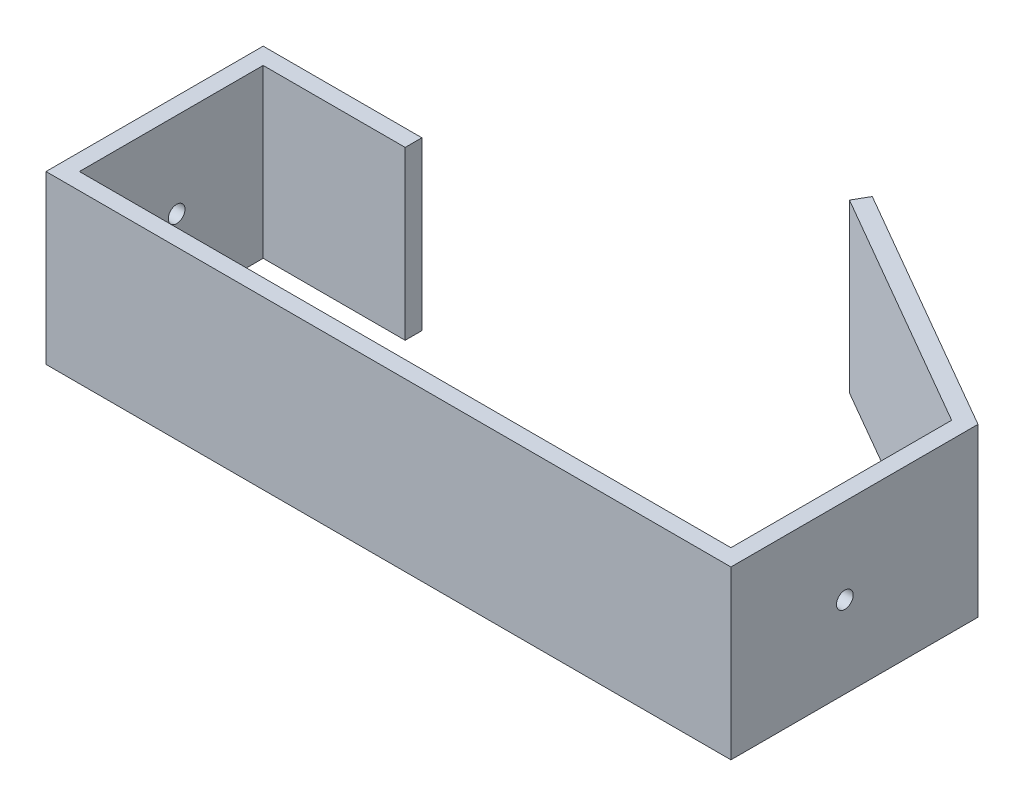
ISO-10303-21;
HEADER;
FILE_DESCRIPTION(('STEP AP214'),'2;1');
FILE_NAME('part.step','',(''),(''),'','','');
FILE_SCHEMA(('AUTOMOTIVE_DESIGN { 1 0 10303 214 1 1 1 1 }'));
ENDSEC;
DATA;
#1=APPLICATION_CONTEXT('core data for automotive mechanical design processes');
#2=APPLICATION_PROTOCOL_DEFINITION('international standard','automotive_design',2000,#1);
#3=PRODUCT_CONTEXT('',#1,'mechanical');
#4=PRODUCT('Part','Part','',(#3));
#5=PRODUCT_RELATED_PRODUCT_CATEGORY('part','',(#4));
#6=PRODUCT_DEFINITION_FORMATION('','',#4);
#7=PRODUCT_DEFINITION_CONTEXT('part definition',#1,'design');
#8=PRODUCT_DEFINITION('design','',#6,#7);
#9=PRODUCT_DEFINITION_SHAPE('','',#8);
#10=(LENGTH_UNIT() NAMED_UNIT(*) SI_UNIT(.MILLI.,.METRE.));
#11=(NAMED_UNIT(*) PLANE_ANGLE_UNIT() SI_UNIT($,.RADIAN.));
#12=(NAMED_UNIT(*) SI_UNIT($,.STERADIAN.) SOLID_ANGLE_UNIT());
#13=UNCERTAINTY_MEASURE_WITH_UNIT(LENGTH_MEASURE(1.E-05),#10,'distance_accuracy_value','');
#14=(GEOMETRIC_REPRESENTATION_CONTEXT(3) GLOBAL_UNCERTAINTY_ASSIGNED_CONTEXT((#13)) GLOBAL_UNIT_ASSIGNED_CONTEXT((#10,
#11,#12)) REPRESENTATION_CONTEXT('',''));
#15=CARTESIAN_POINT('',(0.,0.,0.));
#16=DIRECTION('',(0.,0.,1.));
#17=DIRECTION('',(1.,0.,0.));
#18=AXIS2_PLACEMENT_3D('',#15,#16,#17);
#19=CARTESIAN_POINT('',(-126.387840678323,50.,54.9999999999998));
#20=DIRECTION('',(0.,0.,-1.));
#21=DIRECTION('',(-1.,0.,0.));
#22=AXIS2_PLACEMENT_3D('',#19,#20,#21);
#23=PLANE('',#22);
#24=DIRECTION('',(1.,0.,0.));
#25=VECTOR('',#24,1.);
#26=CARTESIAN_POINT('',(-126.387840678323,0.,54.9999999999998));
#27=LINE('',#26,#25);
#28=CARTESIAN_POINT('',(-123.887840678323,0.,54.9999999999998));
#29=VERTEX_POINT('',#28);
#30=CARTESIAN_POINT('',(-81.3878406783226,0.,54.9999999999998));
#31=VERTEX_POINT('',#30);
#32=EDGE_CURVE('E165',#29,#31,#27,.T.);
#33=ORIENTED_EDGE('',*,*,#32,.T.);
#34=DIRECTION('',(0.,-1.,0.));
#35=VECTOR('',#34,1.);
#36=CARTESIAN_POINT('',(-81.3878406783226,50.,54.9999999999998));
#37=LINE('',#36,#35);
#38=CARTESIAN_POINT('',(-81.3878406783226,50.,54.9999999999998));
#39=VERTEX_POINT('',#38);
#40=EDGE_CURVE('E11',#39,#31,#37,.T.);
#41=ORIENTED_EDGE('',*,*,#40,.F.);
#42=DIRECTION('',(1.,0.,0.));
#43=VECTOR('',#42,1.);
#44=CARTESIAN_POINT('',(-126.387840678323,50.,54.9999999999998));
#45=LINE('',#44,#43);
#46=CARTESIAN_POINT('',(-123.887840678323,50.,54.9999999999998));
#47=VERTEX_POINT('',#46);
#48=EDGE_CURVE('E109',#47,#39,#45,.T.);
#49=ORIENTED_EDGE('',*,*,#48,.F.);
#50=DIRECTION('',(0.,-1.,0.));
#51=VECTOR('',#50,1.);
#52=CARTESIAN_POINT('',(-123.887840678323,50.,54.9999999999998));
#53=LINE('',#52,#51);
#54=EDGE_CURVE('E161',#47,#29,#53,.T.);
#55=ORIENTED_EDGE('',*,*,#54,.T.);
#56=EDGE_LOOP('',(#33,#41,#49,#55));
#57=FACE_BOUND('',#56,.T.);
#58=ADVANCED_FACE('F39',(#57),#23,.F.);
#59=CARTESIAN_POINT('',(-81.3878406783226,50.,49.9999999999998));
#60=DIRECTION('',(1.,0.,0.));
#61=DIRECTION('',(0.,0.,-1.));
#62=AXIS2_PLACEMENT_3D('',#59,#60,#61);
#63=PLANE('',#62);
#64=DIRECTION('',(0.,0.,1.));
#65=VECTOR('',#64,1.);
#66=CARTESIAN_POINT('',(-81.3878406783226,0.,49.9999999999998));
#67=LINE('',#66,#65);
#68=CARTESIAN_POINT('',(-81.3878406783226,0.,49.9999999999998));
#69=VERTEX_POINT('',#68);
#70=EDGE_CURVE('E169',#69,#31,#67,.T.);
#71=ORIENTED_EDGE('',*,*,#70,.F.);
#72=DIRECTION('',(0.,-1.,0.));
#73=VECTOR('',#72,1.);
#74=CARTESIAN_POINT('',(-81.3878406783226,50.,49.9999999999998));
#75=LINE('',#74,#73);
#76=CARTESIAN_POINT('',(-81.3878406783226,50.,49.9999999999998));
#77=VERTEX_POINT('',#76);
#78=EDGE_CURVE('E49',#77,#69,#75,.T.);
#79=ORIENTED_EDGE('',*,*,#78,.F.);
#80=DIRECTION('',(0.,0.,1.));
#81=VECTOR('',#80,1.);
#82=CARTESIAN_POINT('',(-81.3878406783226,50.,49.9999999999998));
#83=LINE('',#82,#81);
#84=EDGE_CURVE('E254',#77,#39,#83,.T.);
#85=ORIENTED_EDGE('',*,*,#84,.T.);
#86=ORIENTED_EDGE('',*,*,#40,.T.);
#87=EDGE_LOOP('',(#71,#79,#85,#86));
#88=FACE_BOUND('',#87,.T.);
#89=ADVANCED_FACE('F241',(#88),#63,.T.);
#90=CARTESIAN_POINT('',(-126.387840678323,50.,49.9999999999998));
#91=DIRECTION('',(0.,0.,-1.));
#92=DIRECTION('',(-1.,0.,0.));
#93=AXIS2_PLACEMENT_3D('',#90,#91,#92);
#94=PLANE('',#93);
#95=DIRECTION('',(1.,0.,0.));
#96=VECTOR('',#95,1.);
#97=CARTESIAN_POINT('',(-126.387840678323,0.,49.9999999999998));
#98=LINE('',#97,#96);
#99=CARTESIAN_POINT('',(-128.887840678323,0.,49.9999999999998));
#100=VERTEX_POINT('',#99);
#101=EDGE_CURVE('E174',#100,#69,#98,.T.);
#102=ORIENTED_EDGE('',*,*,#101,.F.);
#103=DIRECTION('',(0.,-1.,0.));
#104=VECTOR('',#103,1.);
#105=CARTESIAN_POINT('',(-128.887840678323,50.,49.9999999999998));
#106=LINE('',#105,#104);
#107=CARTESIAN_POINT('',(-128.887840678323,50.,49.9999999999998));
#108=VERTEX_POINT('',#107);
#109=EDGE_CURVE('E228',#108,#100,#106,.T.);
#110=ORIENTED_EDGE('',*,*,#109,.F.);
#111=DIRECTION('',(1.,0.,0.));
#112=VECTOR('',#111,1.);
#113=CARTESIAN_POINT('',(-126.387840678323,50.,49.9999999999998));
#114=LINE('',#113,#112);
#115=EDGE_CURVE('E238',#108,#77,#114,.T.);
#116=ORIENTED_EDGE('',*,*,#115,.T.);
#117=ORIENTED_EDGE('',*,*,#78,.T.);
#118=EDGE_LOOP('',(#102,#110,#116,#117));
#119=FACE_BOUND('',#118,.T.);
#120=ADVANCED_FACE('F236',(#119),#94,.T.);
#121=CARTESIAN_POINT('',(-128.887840678323,50.,112.5));
#122=DIRECTION('',(-1.,0.,0.));
#123=DIRECTION('',(0.,0.,1.));
#124=AXIS2_PLACEMENT_3D('',#121,#122,#123);
#125=PLANE('',#124);
#126=CARTESIAN_POINT('',(-128.887840678323,24.4516669544434,80.9096776134965));
#127=DIRECTION('',(1.,0.,0.));
#128=DIRECTION('',(0.,0.,-1.));
#129=AXIS2_PLACEMENT_3D('',#126,#127,#128);
#130=CIRCLE('',#129,2.5);
#131=CARTESIAN_POINT('',(-128.887840678323,24.4516669544434,78.4096776134965));
#132=VERTEX_POINT('',#131);
#133=EDGE_CURVE('E335',#132,#132,#130,.T.);
#134=ORIENTED_EDGE('',*,*,#133,.T.);
#135=EDGE_LOOP('',(#134));
#136=FACE_BOUND('',#135,.T.);
#137=DIRECTION('',(0.,0.,-1.));
#138=VECTOR('',#137,1.);
#139=CARTESIAN_POINT('',(-128.887840678323,0.,112.5));
#140=LINE('',#139,#138);
#141=CARTESIAN_POINT('',(-128.887840678323,0.,115.));
#142=VERTEX_POINT('',#141);
#143=EDGE_CURVE('E178',#142,#100,#140,.T.);
#144=ORIENTED_EDGE('',*,*,#143,.F.);
#145=DIRECTION('',(0.,-1.,0.));
#146=VECTOR('',#145,1.);
#147=CARTESIAN_POINT('',(-128.887840678323,50.,115.));
#148=LINE('',#147,#146);
#149=CARTESIAN_POINT('',(-128.887840678323,50.,115.));
#150=VERTEX_POINT('',#149);
#151=EDGE_CURVE('E225',#150,#142,#148,.T.);
#152=ORIENTED_EDGE('',*,*,#151,.F.);
#153=DIRECTION('',(0.,0.,-1.));
#154=VECTOR('',#153,1.);
#155=CARTESIAN_POINT('',(-128.887840678323,50.,112.5));
#156=LINE('',#155,#154);
#157=EDGE_CURVE('E251',#150,#108,#156,.T.);
#158=ORIENTED_EDGE('',*,*,#157,.T.);
#159=ORIENTED_EDGE('',*,*,#109,.T.);
#160=EDGE_LOOP('',(#144,#152,#158,#159));
#161=FACE_BOUND('',#160,.T.);
#162=ADVANCED_FACE('F248',(#136,#161),#125,.T.);
#163=CARTESIAN_POINT('',(73.6121593216774,50.,115.));
#164=DIRECTION('',(0.,0.,1.));
#165=DIRECTION('',(1.,0.,0.));
#166=AXIS2_PLACEMENT_3D('',#163,#164,#165);
#167=PLANE('',#166);
#168=DIRECTION('',(1.,0.,0.));
#169=VECTOR('',#168,1.);
#170=CARTESIAN_POINT('',(73.6121593216774,0.,115.));
#171=LINE('',#170,#169);
#172=CARTESIAN_POINT('',(76.1121593216774,0.,115.));
#173=VERTEX_POINT('',#172);
#174=EDGE_CURVE('E182',#173,#142,#171,.F.);
#175=ORIENTED_EDGE('',*,*,#174,.F.);
#176=DIRECTION('',(0.,-1.,0.));
#177=VECTOR('',#176,1.);
#178=CARTESIAN_POINT('',(76.1121593216774,50.,115.));
#179=LINE('',#178,#177);
#180=CARTESIAN_POINT('',(76.1121593216774,50.,115.));
#181=VERTEX_POINT('',#180);
#182=EDGE_CURVE('E222',#181,#173,#179,.T.);
#183=ORIENTED_EDGE('',*,*,#182,.F.);
#184=DIRECTION('',(1.,0.,0.));
#185=VECTOR('',#184,1.);
#186=CARTESIAN_POINT('',(73.6121593216774,50.,115.));
#187=LINE('',#186,#185);
#188=EDGE_CURVE('E259',#181,#150,#187,.F.);
#189=ORIENTED_EDGE('',*,*,#188,.T.);
#190=ORIENTED_EDGE('',*,*,#151,.T.);
#191=EDGE_LOOP('',(#175,#183,#189,#190));
#192=FACE_BOUND('',#191,.T.);
#193=ADVANCED_FACE('F347',(#192),#167,.T.);
#194=CARTESIAN_POINT('',(76.1121593216774,50.,42.4999999999998));
#195=DIRECTION('',(1.,0.,0.));
#196=DIRECTION('',(0.,0.,-1.));
#197=AXIS2_PLACEMENT_3D('',#194,#195,#196);
#198=PLANE('',#197);
#199=CARTESIAN_POINT('',(76.1121593216774,24.4516669544434,80.9096776134965));
#200=DIRECTION('',(1.,0.,0.));
#201=DIRECTION('',(0.,0.,-1.));
#202=AXIS2_PLACEMENT_3D('',#199,#200,#201);
#203=CIRCLE('',#202,2.5);
#204=CARTESIAN_POINT('',(76.1121593216774,24.4516669544434,78.4096776134965));
#205=VERTEX_POINT('',#204);
#206=EDGE_CURVE('E329',#205,#205,#203,.T.);
#207=ORIENTED_EDGE('',*,*,#206,.F.);
#208=EDGE_LOOP('',(#207));
#209=FACE_BOUND('',#208,.T.);
#210=DIRECTION('',(0.,0.,-1.));
#211=VECTOR('',#210,1.);
#212=CARTESIAN_POINT('',(76.1121593216774,0.,42.4999999999998));
#213=LINE('',#212,#211);
#214=CARTESIAN_POINT('',(76.1121593216774,0.,41.0566243270257));
#215=VERTEX_POINT('',#214);
#216=EDGE_CURVE('E186',#215,#173,#213,.F.);
#217=ORIENTED_EDGE('',*,*,#216,.F.);
#218=DIRECTION('',(0.,-1.,0.));
#219=VECTOR('',#218,1.);
#220=CARTESIAN_POINT('',(76.1121593216774,50.,41.0566243270257));
#221=LINE('',#220,#219);
#222=CARTESIAN_POINT('',(76.1121593216774,50.,41.0566243270257));
#223=VERTEX_POINT('',#222);
#224=EDGE_CURVE('E219',#223,#215,#221,.T.);
#225=ORIENTED_EDGE('',*,*,#224,.F.);
#226=DIRECTION('',(0.,0.,-1.));
#227=VECTOR('',#226,1.);
#228=CARTESIAN_POINT('',(76.1121593216774,50.,42.4999999999998));
#229=LINE('',#228,#227);
#230=EDGE_CURVE('E266',#223,#181,#229,.F.);
#231=ORIENTED_EDGE('',*,*,#230,.T.);
#232=ORIENTED_EDGE('',*,*,#182,.T.);
#233=EDGE_LOOP('',(#217,#225,#231,#232));
#234=FACE_BOUND('',#233,.T.);
#235=ADVANCED_FACE('F353',(#209,#234),#198,.T.);
#236=CARTESIAN_POINT('',(1.24999999999999,50.,-2.1650635094611));
#237=DIRECTION('',(0.499999999999998,0.,-0.86602540378444));
#238=DIRECTION('',(-0.86602540378444,0.,-0.499999999999998));
#239=AXIS2_PLACEMENT_3D('',#236,#237,#238);
#240=PLANE('',#239);
#241=DIRECTION('',(0.86602540378444,0.,0.499999999999998));
#242=VECTOR('',#241,1.);
#243=CARTESIAN_POINT('',(1.24999999999999,0.,-2.1650635094611));
#244=LINE('',#243,#242);
#245=CARTESIAN_POINT('',(1.24999999999999,0.,-2.1650635094611));
#246=VERTEX_POINT('',#245);
#247=EDGE_CURVE('E190',#246,#215,#244,.T.);
#248=ORIENTED_EDGE('',*,*,#247,.F.);
#249=DIRECTION('',(0.,-1.,0.));
#250=VECTOR('',#249,1.);
#251=CARTESIAN_POINT('',(1.24999999999999,50.,-2.1650635094611));
#252=LINE('',#251,#250);
#253=CARTESIAN_POINT('',(1.24999999999999,50.,-2.1650635094611));
#254=VERTEX_POINT('',#253);
#255=EDGE_CURVE('E216',#254,#246,#252,.T.);
#256=ORIENTED_EDGE('',*,*,#255,.F.);
#257=DIRECTION('',(0.86602540378444,0.,0.499999999999998));
#258=VECTOR('',#257,1.);
#259=CARTESIAN_POINT('',(1.24999999999999,50.,-2.1650635094611));
#260=LINE('',#259,#258);
#261=EDGE_CURVE('E270',#254,#223,#260,.T.);
#262=ORIENTED_EDGE('',*,*,#261,.T.);
#263=ORIENTED_EDGE('',*,*,#224,.T.);
#264=EDGE_LOOP('',(#248,#256,#262,#263));
#265=FACE_BOUND('',#264,.T.);
#266=ADVANCED_FACE('F285',(#265),#240,.T.);
#267=CARTESIAN_POINT('',(-1.24999999999999,50.,2.1650635094611));
#268=DIRECTION('',(-0.86602540378444,0.,-0.499999999999998));
#269=DIRECTION('',(-0.499999999999998,0.,0.86602540378444));
#270=AXIS2_PLACEMENT_3D('',#267,#268,#269);
#271=PLANE('',#270);
#272=DIRECTION('',(0.499999999999998,0.,-0.86602540378444));
#273=VECTOR('',#272,1.);
#274=CARTESIAN_POINT('',(-1.24999999999999,0.,2.1650635094611));
#275=LINE('',#274,#273);
#276=CARTESIAN_POINT('',(-1.24999999999999,0.,2.1650635094611));
#277=VERTEX_POINT('',#276);
#278=EDGE_CURVE('E194',#277,#246,#275,.T.);
#279=ORIENTED_EDGE('',*,*,#278,.F.);
#280=DIRECTION('',(0.,-1.,0.));
#281=VECTOR('',#280,1.);
#282=CARTESIAN_POINT('',(-1.24999999999999,50.,2.1650635094611));
#283=LINE('',#282,#281);
#284=CARTESIAN_POINT('',(-1.24999999999999,50.,2.1650635094611));
#285=VERTEX_POINT('',#284);
#286=EDGE_CURVE('E213',#285,#277,#283,.T.);
#287=ORIENTED_EDGE('',*,*,#286,.F.);
#288=DIRECTION('',(0.499999999999998,0.,-0.86602540378444));
#289=VECTOR('',#288,1.);
#290=CARTESIAN_POINT('',(-1.24999999999999,50.,2.1650635094611));
#291=LINE('',#290,#289);
#292=EDGE_CURVE('E274',#285,#254,#291,.T.);
#293=ORIENTED_EDGE('',*,*,#292,.T.);
#294=ORIENTED_EDGE('',*,*,#255,.T.);
#295=EDGE_LOOP('',(#279,#287,#293,#294));
#296=FACE_BOUND('',#295,.T.);
#297=ADVANCED_FACE('F280',(#296),#271,.T.);
#298=CARTESIAN_POINT('',(-1.24999999999999,50.,2.1650635094611));
#299=DIRECTION('',(0.499999999999998,0.,-0.86602540378444));
#300=DIRECTION('',(-0.86602540378444,0.,-0.499999999999998));
#301=AXIS2_PLACEMENT_3D('',#298,#299,#300);
#302=PLANE('',#301);
#303=DIRECTION('',(0.86602540378444,0.,0.499999999999998));
#304=VECTOR('',#303,1.);
#305=CARTESIAN_POINT('',(-1.24999999999999,0.,2.1650635094611));
#306=LINE('',#305,#304);
#307=CARTESIAN_POINT('',(71.1121593216774,0.,43.9433756729739));
#308=VERTEX_POINT('',#307);
#309=EDGE_CURVE('E198',#277,#308,#306,.T.);
#310=ORIENTED_EDGE('',*,*,#309,.T.);
#311=DIRECTION('',(0.,-1.,0.));
#312=VECTOR('',#311,1.);
#313=CARTESIAN_POINT('',(71.1121593216774,50.,43.9433756729739));
#314=LINE('',#313,#312);
#315=CARTESIAN_POINT('',(71.1121593216774,50.,43.9433756729739));
#316=VERTEX_POINT('',#315);
#317=EDGE_CURVE('E154',#316,#308,#314,.T.);
#318=ORIENTED_EDGE('',*,*,#317,.F.);
#319=DIRECTION('',(0.86602540378444,0.,0.499999999999998));
#320=VECTOR('',#319,1.);
#321=CARTESIAN_POINT('',(-1.24999999999999,50.,2.1650635094611));
#322=LINE('',#321,#320);
#323=EDGE_CURVE('E143',#285,#316,#322,.T.);
#324=ORIENTED_EDGE('',*,*,#323,.F.);
#325=ORIENTED_EDGE('',*,*,#286,.T.);
#326=EDGE_LOOP('',(#310,#318,#324,#325));
#327=FACE_BOUND('',#326,.T.);
#328=ADVANCED_FACE('F289',(#327),#302,.F.);
#329=CARTESIAN_POINT('',(71.1121593216774,50.,42.4999999999998));
#330=DIRECTION('',(1.,0.,0.));
#331=DIRECTION('',(0.,0.,-1.));
#332=AXIS2_PLACEMENT_3D('',#329,#330,#331);
#333=PLANE('',#332);
#334=CARTESIAN_POINT('',(71.1121593216774,24.4516669544434,80.9096776134965));
#335=DIRECTION('',(1.,0.,0.));
#336=DIRECTION('',(0.,0.,-1.));
#337=AXIS2_PLACEMENT_3D('',#334,#335,#336);
#338=CIRCLE('',#337,2.5);
#339=CARTESIAN_POINT('',(71.1121593216774,24.4516669544434,78.4096776134965));
#340=VERTEX_POINT('',#339);
#341=EDGE_CURVE('E170',#340,#340,#338,.T.);
#342=ORIENTED_EDGE('',*,*,#341,.T.);
#343=EDGE_LOOP('',(#342));
#344=FACE_BOUND('',#343,.T.);
#345=DIRECTION('',(0.,0.,-1.));
#346=VECTOR('',#345,1.);
#347=CARTESIAN_POINT('',(71.1121593216774,0.,42.4999999999998));
#348=LINE('',#347,#346);
#349=CARTESIAN_POINT('',(71.1121593216774,0.,110.));
#350=VERTEX_POINT('',#349);
#351=EDGE_CURVE('E152',#308,#350,#348,.F.);
#352=ORIENTED_EDGE('',*,*,#351,.T.);
#353=DIRECTION('',(0.,-1.,0.));
#354=VECTOR('',#353,1.);
#355=CARTESIAN_POINT('',(71.1121593216774,50.,110.));
#356=LINE('',#355,#354);
#357=CARTESIAN_POINT('',(71.1121593216774,50.,110.));
#358=VERTEX_POINT('',#357);
#359=EDGE_CURVE('E149',#358,#350,#356,.T.);
#360=ORIENTED_EDGE('',*,*,#359,.F.);
#361=DIRECTION('',(0.,0.,-1.));
#362=VECTOR('',#361,1.);
#363=CARTESIAN_POINT('',(71.1121593216774,50.,42.4999999999998));
#364=LINE('',#363,#362);
#365=EDGE_CURVE('E136',#316,#358,#364,.F.);
#366=ORIENTED_EDGE('',*,*,#365,.F.);
#367=ORIENTED_EDGE('',*,*,#317,.T.);
#368=EDGE_LOOP('',(#352,#360,#366,#367));
#369=FACE_BOUND('',#368,.T.);
#370=ADVANCED_FACE('F150',(#344,#369),#333,.F.);
#371=CARTESIAN_POINT('',(73.6121593216774,50.,110.));
#372=DIRECTION('',(0.,0.,1.));
#373=DIRECTION('',(1.,0.,0.));
#374=AXIS2_PLACEMENT_3D('',#371,#372,#373);
#375=PLANE('',#374);
#376=DIRECTION('',(1.,0.,0.));
#377=VECTOR('',#376,1.);
#378=CARTESIAN_POINT('',(73.6121593216774,0.,110.));
#379=LINE('',#378,#377);
#380=CARTESIAN_POINT('',(-123.887840678323,0.,110.));
#381=VERTEX_POINT('',#380);
#382=EDGE_CURVE('E97',#350,#381,#379,.F.);
#383=ORIENTED_EDGE('',*,*,#382,.T.);
#384=DIRECTION('',(0.,-1.,0.));
#385=VECTOR('',#384,1.);
#386=CARTESIAN_POINT('',(-123.887840678323,50.,110.));
#387=LINE('',#386,#385);
#388=CARTESIAN_POINT('',(-123.887840678323,50.,110.));
#389=VERTEX_POINT('',#388);
#390=EDGE_CURVE('E155',#389,#381,#387,.T.);
#391=ORIENTED_EDGE('',*,*,#390,.F.);
#392=DIRECTION('',(1.,0.,0.));
#393=VECTOR('',#392,1.);
#394=CARTESIAN_POINT('',(73.6121593216774,50.,110.));
#395=LINE('',#394,#393);
#396=EDGE_CURVE('E140',#358,#389,#395,.F.);
#397=ORIENTED_EDGE('',*,*,#396,.F.);
#398=ORIENTED_EDGE('',*,*,#359,.T.);
#399=EDGE_LOOP('',(#383,#391,#397,#398));
#400=FACE_BOUND('',#399,.T.);
#401=ADVANCED_FACE('F157',(#400),#375,.F.);
#402=CARTESIAN_POINT('',(-123.887840678323,50.,112.5));
#403=DIRECTION('',(-1.,0.,0.));
#404=DIRECTION('',(0.,0.,1.));
#405=AXIS2_PLACEMENT_3D('',#402,#403,#404);
#406=PLANE('',#405);
#407=CARTESIAN_POINT('',(-123.887840678323,24.4516669544434,80.9096776134965));
#408=DIRECTION('',(-1.,0.,0.));
#409=DIRECTION('',(0.,0.,1.));
#410=AXIS2_PLACEMENT_3D('',#407,#408,#409);
#411=CIRCLE('',#410,2.5);
#412=CARTESIAN_POINT('',(-123.887840678323,24.4516669544434,83.4096776134965));
#413=VERTEX_POINT('',#412);
#414=EDGE_CURVE('E42',#413,#413,#411,.T.);
#415=ORIENTED_EDGE('',*,*,#414,.T.);
#416=EDGE_LOOP('',(#415));
#417=FACE_BOUND('',#416,.T.);
#418=DIRECTION('',(0.,0.,-1.));
#419=VECTOR('',#418,1.);
#420=CARTESIAN_POINT('',(-123.887840678323,0.,112.5));
#421=LINE('',#420,#419);
#422=EDGE_CURVE('E103',#381,#29,#421,.T.);
#423=ORIENTED_EDGE('',*,*,#422,.T.);
#424=ORIENTED_EDGE('',*,*,#54,.F.);
#425=DIRECTION('',(0.,0.,-1.));
#426=VECTOR('',#425,1.);
#427=CARTESIAN_POINT('',(-123.887840678323,50.,112.5));
#428=LINE('',#427,#426);
#429=EDGE_CURVE('E57',#389,#47,#428,.T.);
#430=ORIENTED_EDGE('',*,*,#429,.F.);
#431=ORIENTED_EDGE('',*,*,#390,.T.);
#432=EDGE_LOOP('',(#423,#424,#430,#431));
#433=FACE_BOUND('',#432,.T.);
#434=ADVANCED_FACE('F304',(#417,#433),#406,.F.);
#435=CARTESIAN_POINT('',(0.,50.,0.));
#436=DIRECTION('',(0.,-1.,0.));
#437=DIRECTION('',(-1.,0.,0.));
#438=AXIS2_PLACEMENT_3D('',#435,#436,#437);
#439=PLANE('',#438);
#440=ORIENTED_EDGE('',*,*,#48,.T.);
#441=ORIENTED_EDGE('',*,*,#84,.F.);
#442=ORIENTED_EDGE('',*,*,#115,.F.);
#443=ORIENTED_EDGE('',*,*,#157,.F.);
#444=ORIENTED_EDGE('',*,*,#188,.F.);
#445=ORIENTED_EDGE('',*,*,#230,.F.);
#446=ORIENTED_EDGE('',*,*,#261,.F.);
#447=ORIENTED_EDGE('',*,*,#292,.F.);
#448=ORIENTED_EDGE('',*,*,#323,.T.);
#449=ORIENTED_EDGE('',*,*,#365,.T.);
#450=ORIENTED_EDGE('',*,*,#396,.T.);
#451=ORIENTED_EDGE('',*,*,#429,.T.);
#452=EDGE_LOOP('',(#440,#441,#442,#443,#444,#445,#446,#447,#448,#449,#450,#451));
#453=FACE_BOUND('',#452,.T.);
#454=ADVANCED_FACE('F138',(#453),#439,.F.);
#455=CARTESIAN_POINT('',(0.,0.,0.));
#456=DIRECTION('',(0.,-1.,0.));
#457=DIRECTION('',(-1.,0.,0.));
#458=AXIS2_PLACEMENT_3D('',#455,#456,#457);
#459=PLANE('',#458);
#460=ORIENTED_EDGE('',*,*,#32,.F.);
#461=ORIENTED_EDGE('',*,*,#422,.F.);
#462=ORIENTED_EDGE('',*,*,#382,.F.);
#463=ORIENTED_EDGE('',*,*,#351,.F.);
#464=ORIENTED_EDGE('',*,*,#309,.F.);
#465=ORIENTED_EDGE('',*,*,#278,.T.);
#466=ORIENTED_EDGE('',*,*,#247,.T.);
#467=ORIENTED_EDGE('',*,*,#216,.T.);
#468=ORIENTED_EDGE('',*,*,#174,.T.);
#469=ORIENTED_EDGE('',*,*,#143,.T.);
#470=ORIENTED_EDGE('',*,*,#101,.T.);
#471=ORIENTED_EDGE('',*,*,#70,.T.);
#472=EDGE_LOOP('',(#460,#461,#462,#463,#464,#465,#466,#467,#468,#469,#470,#471));
#473=FACE_BOUND('',#472,.T.);
#474=ADVANCED_FACE('F244',(#473),#459,.T.);
#475=CARTESIAN_POINT('',(-128.887840678323,24.4516669544434,80.9096776134965));
#476=DIRECTION('',(1.,0.,0.));
#477=DIRECTION('',(0.,0.,-1.));
#478=AXIS2_PLACEMENT_3D('',#475,#476,#477);
#479=CYLINDRICAL_SURFACE('',#478,2.5);
#480=ORIENTED_EDGE('',*,*,#133,.F.);
#481=EDGE_LOOP('',(#480));
#482=FACE_BOUND('',#481,.T.);
#483=ORIENTED_EDGE('',*,*,#414,.F.);
#484=EDGE_LOOP('',(#483));
#485=FACE_BOUND('',#484,.T.);
#486=ADVANCED_FACE('F317',(#482,#485),#479,.F.);
#487=ORIENTED_EDGE('',*,*,#206,.T.);
#488=EDGE_LOOP('',(#487));
#489=FACE_BOUND('',#488,.T.);
#490=ORIENTED_EDGE('',*,*,#341,.F.);
#491=EDGE_LOOP('',(#490));
#492=FACE_BOUND('',#491,.T.);
#493=ADVANCED_FACE('F319',(#489,#492),#479,.F.);
#494=CLOSED_SHELL('',(#58,#89,#120,#162,#193,#235,#266,#297,#328,#370,#401,#434,#454,#474,#486,#493));
#495=MANIFOLD_SOLID_BREP('B2',#494);
#496=ADVANCED_BREP_SHAPE_REPRESENTATION('',(#18,#495),#14);
#497=SHAPE_DEFINITION_REPRESENTATION(#9,#496);
ENDSEC;
END-ISO-10303-21;
